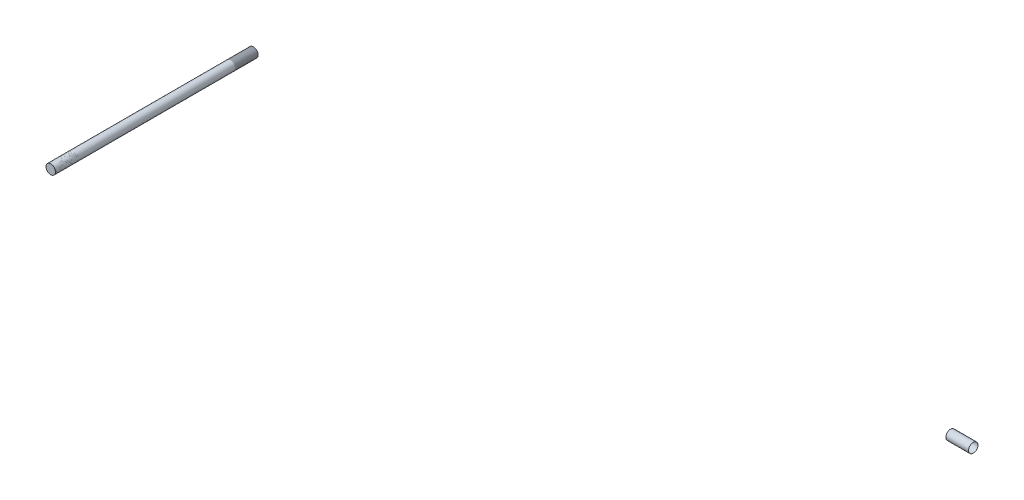
ISO-10303-21;
HEADER;
FILE_DESCRIPTION(('STEP AP214'),'2;1');
FILE_NAME('part.step','',(''),(''),'','','');
FILE_SCHEMA(('AUTOMOTIVE_DESIGN { 1 0 10303 214 1 1 1 1 }'));
ENDSEC;
DATA;
#1=APPLICATION_CONTEXT('core data for automotive mechanical design processes');
#2=APPLICATION_PROTOCOL_DEFINITION('international standard','automotive_design',2000,#1);
#3=PRODUCT_CONTEXT('',#1,'mechanical');
#4=PRODUCT('Part','Part','',(#3));
#5=PRODUCT_RELATED_PRODUCT_CATEGORY('part','',(#4));
#6=PRODUCT_DEFINITION_FORMATION('','',#4);
#7=PRODUCT_DEFINITION_CONTEXT('part definition',#1,'design');
#8=PRODUCT_DEFINITION('design','',#6,#7);
#9=PRODUCT_DEFINITION_SHAPE('','',#8);
#10=(LENGTH_UNIT() NAMED_UNIT(*) SI_UNIT(.MILLI.,.METRE.));
#11=(NAMED_UNIT(*) PLANE_ANGLE_UNIT() SI_UNIT($,.RADIAN.));
#12=(NAMED_UNIT(*) SI_UNIT($,.STERADIAN.) SOLID_ANGLE_UNIT());
#13=UNCERTAINTY_MEASURE_WITH_UNIT(LENGTH_MEASURE(1.E-05),#10,'distance_accuracy_value','');
#14=(GEOMETRIC_REPRESENTATION_CONTEXT(3) GLOBAL_UNCERTAINTY_ASSIGNED_CONTEXT((#13)) GLOBAL_UNIT_ASSIGNED_CONTEXT((#10,
#11,#12)) REPRESENTATION_CONTEXT('',''));
#15=CARTESIAN_POINT('',(0.,0.,0.));
#16=DIRECTION('',(0.,0.,1.));
#17=DIRECTION('',(1.,0.,0.));
#18=AXIS2_PLACEMENT_3D('',#15,#16,#17);
#19=CARTESIAN_POINT('',(0.,0.,-15.2399999999999));
#20=DIRECTION('',(0.,0.,-1.));
#21=DIRECTION('',(-1.,0.,0.));
#22=AXIS2_PLACEMENT_3D('',#19,#20,#21);
#23=PLANE('',#22);
#24=CARTESIAN_POINT('',(-26.9240000000002,0.,-15.2399999999999));
#25=DIRECTION('',(0.,0.,-1.));
#26=DIRECTION('',(-1.,0.,0.));
#27=AXIS2_PLACEMENT_3D('',#24,#25,#26);
#28=CIRCLE('',#27,3.17500000000014);
#29=CARTESIAN_POINT('',(-30.0990000000003,0.,-15.2399999999999));
#30=VERTEX_POINT('',#29);
#31=EDGE_CURVE('E11',#30,#30,#28,.F.);
#32=ORIENTED_EDGE('',*,*,#31,.F.);
#33=EDGE_LOOP('',(#32));
#34=FACE_BOUND('',#33,.T.);
#35=ADVANCED_FACE('F44',(#34),#23,.T.);
#36=CARTESIAN_POINT('',(-26.9240000000002,0.,120.797534419398));
#37=DIRECTION('',(0.,0.,1.));
#38=DIRECTION('',(1.,0.,0.));
#39=AXIS2_PLACEMENT_3D('',#36,#37,#38);
#40=PLANE('',#39);
#41=CARTESIAN_POINT('',(-26.9240000000002,0.,120.797534419398));
#42=DIRECTION('',(0.,0.,1.));
#43=DIRECTION('',(1.,0.,0.));
#44=AXIS2_PLACEMENT_3D('',#41,#42,#43);
#45=CIRCLE('',#44,3.17500000000014);
#46=CARTESIAN_POINT('',(-23.749,0.,120.797534419398));
#47=VERTEX_POINT('',#46);
#48=EDGE_CURVE('E50',#47,#47,#45,.T.);
#49=ORIENTED_EDGE('',*,*,#48,.T.);
#50=EDGE_LOOP('',(#49));
#51=FACE_BOUND('',#50,.T.);
#52=ADVANCED_FACE('F56',(#51),#40,.T.);
#53=CARTESIAN_POINT('',(-26.9240000000002,0.,-24.2202561210694));
#54=DIRECTION('',(0.,0.,1.));
#55=DIRECTION('',(1.,0.,0.));
#56=AXIS2_PLACEMENT_3D('',#53,#54,#55);
#57=CYLINDRICAL_SURFACE('',#56,3.17500000000014);
#58=ORIENTED_EDGE('',*,*,#48,.F.);
#59=EDGE_LOOP('',(#58));
#60=FACE_BOUND('',#59,.T.);
#61=ORIENTED_EDGE('',*,*,#31,.T.);
#62=EDGE_LOOP('',(#61));
#63=FACE_BOUND('',#62,.T.);
#64=ADVANCED_FACE('F58',(#60,#63),#57,.T.);
#65=CLOSED_SHELL('',(#35,#52,#64));
#66=MANIFOLD_SOLID_BREP('B2',#65);
#67=CARTESIAN_POINT('',(-26.9240000000002,0.,113.177534419398));
#68=DIRECTION('',(0.,0.,1.));
#69=DIRECTION('',(1.,0.,0.));
#70=AXIS2_PLACEMENT_3D('',#67,#68,#69);
#71=CYLINDRICAL_SURFACE('',#70,3.175);
#72=CARTESIAN_POINT('',(-26.9240000000002,0.,105.557534419398));
#73=DIRECTION('',(0.,0.,1.));
#74=DIRECTION('',(1.,0.,0.));
#75=AXIS2_PLACEMENT_3D('',#72,#73,#74);
#76=CIRCLE('',#75,3.175);
#77=CARTESIAN_POINT('',(-23.7490000000002,0.,105.557534419398));
#78=VERTEX_POINT('',#77);
#79=EDGE_CURVE('E97',#78,#78,#76,.T.);
#80=ORIENTED_EDGE('',*,*,#79,.F.);
#81=EDGE_LOOP('',(#80));
#82=FACE_BOUND('',#81,.T.);
#83=CARTESIAN_POINT('',(-26.9240000000002,0.,120.797534419398));
#84=DIRECTION('',(0.,0.,1.));
#85=DIRECTION('',(1.,0.,0.));
#86=AXIS2_PLACEMENT_3D('',#83,#84,#85);
#87=CIRCLE('',#86,3.175);
#88=CARTESIAN_POINT('',(-23.7490000000002,0.,120.797534419398));
#89=VERTEX_POINT('',#88);
#90=EDGE_CURVE('E43',#89,#89,#87,.F.);
#91=ORIENTED_EDGE('',*,*,#90,.F.);
#92=EDGE_LOOP('',(#91));
#93=FACE_BOUND('',#92,.T.);
#94=ADVANCED_FACE('F93',(#82,#93),#71,.F.);
#95=OPEN_SHELL('',(#94));
#96=SHELL_BASED_SURFACE_MODEL('B6',(#95));
#97=CARTESIAN_POINT('',(436.856294763236,0.,-26.924));
#98=DIRECTION('',(1.,0.,0.));
#99=DIRECTION('',(0.,0.932087451461804,0.362233326500253));
#100=AXIS2_PLACEMENT_3D('',#97,#98,#99);
#101=CYLINDRICAL_SURFACE('',#100,3.175);
#102=CARTESIAN_POINT('',(444.476294763236,1.00606754168216E-13,-26.9239999999999));
#103=DIRECTION('',(1.,0.,0.));
#104=DIRECTION('',(0.,0.932087451461804,0.362233326500253));
#105=AXIS2_PLACEMENT_3D('',#102,#103,#104);
#106=CIRCLE('',#105,3.175);
#107=CARTESIAN_POINT('',(444.476294763236,2.95937765839133,-25.7739091883616));
#108=VERTEX_POINT('',#107);
#109=EDGE_CURVE('E147',#108,#108,#106,.T.);
#110=ORIENTED_EDGE('',*,*,#109,.T.);
#111=EDGE_LOOP('',(#110));
#112=FACE_BOUND('',#111,.T.);
#113=CARTESIAN_POINT('',(429.236294763236,-1.0098364790278E-13,-26.924));
#114=DIRECTION('',(1.,0.,0.));
#115=DIRECTION('',(0.,0.932087451461804,0.362233326500253));
#116=AXIS2_PLACEMENT_3D('',#113,#114,#115);
#117=CIRCLE('',#116,3.175);
#118=CARTESIAN_POINT('',(429.236294763236,2.95937765839113,-25.7739091883617));
#119=VERTEX_POINT('',#118);
#120=EDGE_CURVE('E92',#119,#119,#117,.T.);
#121=ORIENTED_EDGE('',*,*,#120,.F.);
#122=EDGE_LOOP('',(#121));
#123=FACE_BOUND('',#122,.T.);
#124=ADVANCED_FACE('F143',(#112,#123),#101,.F.);
#125=OPEN_SHELL('',(#124));
#126=SHELL_BASED_SURFACE_MODEL('B38',(#125));
#127=CARTESIAN_POINT('',(-26.9240000000002,0.,113.177534419398));
#128=DIRECTION('',(0.,0.,1.));
#129=DIRECTION('',(1.,0.,0.));
#130=AXIS2_PLACEMENT_3D('',#127,#128,#129);
#131=CYLINDRICAL_SURFACE('',#130,3.175);
#132=CARTESIAN_POINT('',(-26.9240000000002,0.,105.557534419398));
#133=DIRECTION('',(0.,0.,1.));
#134=DIRECTION('',(1.,0.,0.));
#135=AXIS2_PLACEMENT_3D('',#132,#133,#134);
#136=CIRCLE('',#135,3.175);
#137=CARTESIAN_POINT('',(-23.7490000000002,0.,105.557534419398));
#138=VERTEX_POINT('',#137);
#139=EDGE_CURVE('E198',#138,#138,#136,.T.);
#140=ORIENTED_EDGE('',*,*,#139,.F.);
#141=EDGE_LOOP('',(#140));
#142=FACE_BOUND('',#141,.T.);
#143=CARTESIAN_POINT('',(-26.9240000000002,0.,120.797534419398));
#144=DIRECTION('',(0.,0.,1.));
#145=DIRECTION('',(1.,0.,0.));
#146=AXIS2_PLACEMENT_3D('',#143,#144,#145);
#147=CIRCLE('',#146,3.175);
#148=CARTESIAN_POINT('',(-23.7490000000002,0.,120.797534419398));
#149=VERTEX_POINT('',#148);
#150=EDGE_CURVE('E141',#149,#149,#147,.F.);
#151=ORIENTED_EDGE('',*,*,#150,.F.);
#152=EDGE_LOOP('',(#151));
#153=FACE_BOUND('',#152,.T.);
#154=ADVANCED_FACE('F193',(#142,#153),#131,.F.);
#155=OPEN_SHELL('',(#154));
#156=SHELL_BASED_SURFACE_MODEL('B87',(#155));
#157=CARTESIAN_POINT('',(-26.9240000000002,0.,113.177534419398));
#158=DIRECTION('',(0.,0.,1.));
#159=DIRECTION('',(1.,0.,0.));
#160=AXIS2_PLACEMENT_3D('',#157,#158,#159);
#161=CYLINDRICAL_SURFACE('',#160,3.175);
#162=CARTESIAN_POINT('',(-26.9240000000002,0.,105.557534419398));
#163=DIRECTION('',(0.,0.,1.));
#164=DIRECTION('',(1.,0.,0.));
#165=AXIS2_PLACEMENT_3D('',#162,#163,#164);
#166=CIRCLE('',#165,3.175);
#167=CARTESIAN_POINT('',(-23.7490000000002,0.,105.557534419398));
#168=VERTEX_POINT('',#167);
#169=EDGE_CURVE('E249',#168,#168,#166,.T.);
#170=ORIENTED_EDGE('',*,*,#169,.F.);
#171=EDGE_LOOP('',(#170));
#172=FACE_BOUND('',#171,.T.);
#173=CARTESIAN_POINT('',(-26.9240000000002,0.,120.797534419398));
#174=DIRECTION('',(0.,0.,1.));
#175=DIRECTION('',(1.,0.,0.));
#176=AXIS2_PLACEMENT_3D('',#173,#174,#175);
#177=CIRCLE('',#176,3.175);
#178=CARTESIAN_POINT('',(-23.7490000000002,0.,120.797534419398));
#179=VERTEX_POINT('',#178);
#180=EDGE_CURVE('E191',#179,#179,#177,.F.);
#181=ORIENTED_EDGE('',*,*,#180,.F.);
#182=EDGE_LOOP('',(#181));
#183=FACE_BOUND('',#182,.T.);
#184=ADVANCED_FACE('F244',(#172,#183),#161,.F.);
#185=OPEN_SHELL('',(#184));
#186=SHELL_BASED_SURFACE_MODEL('B135',(#185));
#187=CARTESIAN_POINT('',(-26.924,0.,-7.62000000000003));
#188=DIRECTION('',(0.,0.,-1.));
#189=DIRECTION('',(-1.,0.,0.));
#190=AXIS2_PLACEMENT_3D('',#187,#188,#189);
#191=CYLINDRICAL_SURFACE('',#190,3.175);
#192=CARTESIAN_POINT('',(-26.924,0.,0.));
#193=DIRECTION('',(0.,0.,-1.));
#194=DIRECTION('',(-1.,0.,0.));
#195=AXIS2_PLACEMENT_3D('',#192,#193,#194);
#196=CIRCLE('',#195,3.175);
#197=CARTESIAN_POINT('',(-30.099,0.,0.));
#198=VERTEX_POINT('',#197);
#199=EDGE_CURVE('E291',#198,#198,#196,.T.);
#200=ORIENTED_EDGE('',*,*,#199,.F.);
#201=EDGE_LOOP('',(#200));
#202=FACE_BOUND('',#201,.T.);
#203=CARTESIAN_POINT('',(-26.924,0.,-15.24));
#204=DIRECTION('',(0.,0.,-1.));
#205=DIRECTION('',(-1.,0.,0.));
#206=AXIS2_PLACEMENT_3D('',#203,#204,#205);
#207=CIRCLE('',#206,3.175);
#208=CARTESIAN_POINT('',(-30.099,0.,-15.24));
#209=VERTEX_POINT('',#208);
#210=EDGE_CURVE('E242',#209,#209,#207,.F.);
#211=ORIENTED_EDGE('',*,*,#210,.F.);
#212=EDGE_LOOP('',(#211));
#213=FACE_BOUND('',#212,.T.);
#214=ADVANCED_FACE('F286',(#202,#213),#191,.F.);
#215=OPEN_SHELL('',(#214));
#216=SHELL_BASED_SURFACE_MODEL('B185',(#215));
#217=ADVANCED_BREP_SHAPE_REPRESENTATION('',(#18,#66),#14);
#218=MANIFOLD_SURFACE_SHAPE_REPRESENTATION('',(#18,#96,#126,#156,#186,#216),#14);
#219=SHAPE_REPRESENTATION('',(#18),#14);
#220=SHAPE_DEFINITION_REPRESENTATION(#9,#219);
#221=SHAPE_REPRESENTATION_RELATIONSHIP('','',#219,#217);
#222=SHAPE_REPRESENTATION_RELATIONSHIP('','',#219,#218);
ENDSEC;
END-ISO-10303-21;
